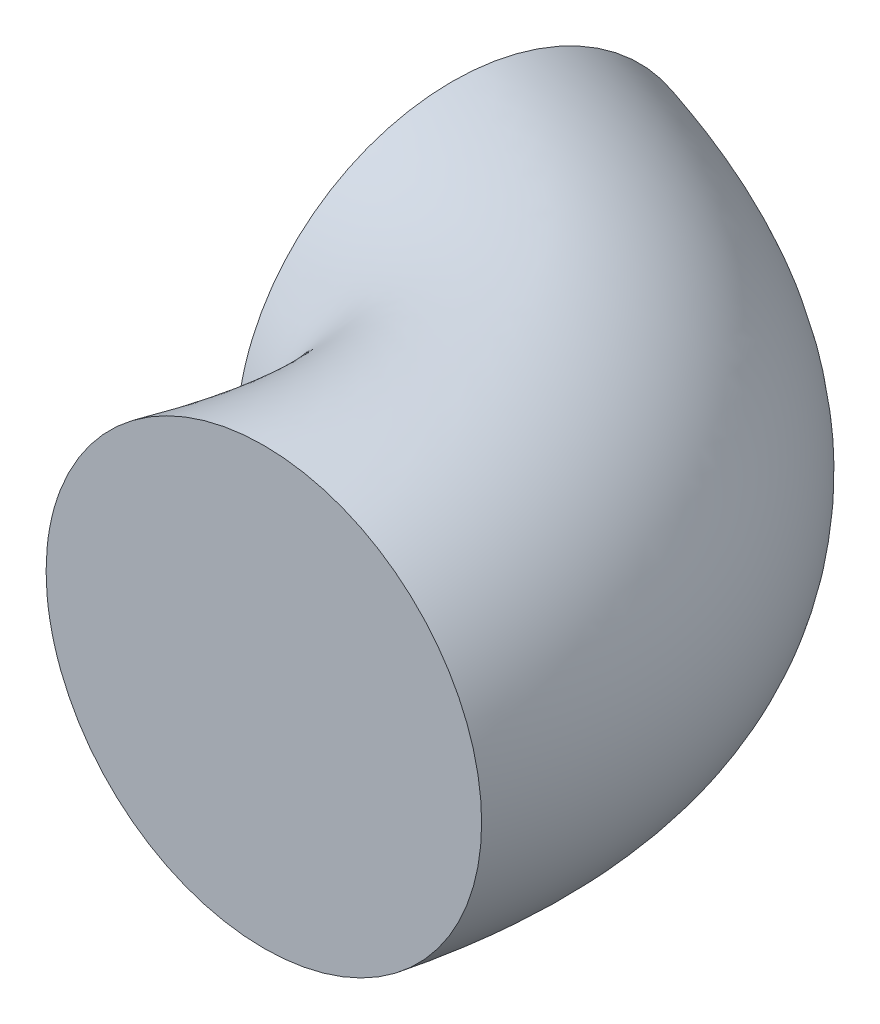
ISO-10303-21;
HEADER;
FILE_DESCRIPTION(('STEP AP214'),'2;1');
FILE_NAME('part.step','',(''),(''),'','','');
FILE_SCHEMA(('AUTOMOTIVE_DESIGN { 1 0 10303 214 1 1 1 1 }'));
ENDSEC;
DATA;
#1=APPLICATION_CONTEXT('core data for automotive mechanical design processes');
#2=APPLICATION_PROTOCOL_DEFINITION('international standard','automotive_design',2000,#1);
#3=PRODUCT_CONTEXT('',#1,'mechanical');
#4=PRODUCT('Part','Part','',(#3));
#5=PRODUCT_RELATED_PRODUCT_CATEGORY('part','',(#4));
#6=PRODUCT_DEFINITION_FORMATION('','',#4);
#7=PRODUCT_DEFINITION_CONTEXT('part definition',#1,'design');
#8=PRODUCT_DEFINITION('design','',#6,#7);
#9=PRODUCT_DEFINITION_SHAPE('','',#8);
#10=(LENGTH_UNIT() NAMED_UNIT(*) SI_UNIT(.MILLI.,.METRE.));
#11=(NAMED_UNIT(*) PLANE_ANGLE_UNIT() SI_UNIT($,.RADIAN.));
#12=(NAMED_UNIT(*) SI_UNIT($,.STERADIAN.) SOLID_ANGLE_UNIT());
#13=UNCERTAINTY_MEASURE_WITH_UNIT(LENGTH_MEASURE(1.E-05),#10,'distance_accuracy_value','');
#14=(GEOMETRIC_REPRESENTATION_CONTEXT(3) GLOBAL_UNCERTAINTY_ASSIGNED_CONTEXT((#13)) GLOBAL_UNIT_ASSIGNED_CONTEXT((#10,
#11,#12)) REPRESENTATION_CONTEXT('',''));
#15=CARTESIAN_POINT('',(0.,0.,0.));
#16=DIRECTION('',(0.,0.,1.));
#17=DIRECTION('',(1.,0.,0.));
#18=AXIS2_PLACEMENT_3D('',#15,#16,#17);
#19=CARTESIAN_POINT('',(0.,0.,0.));
#20=DIRECTION('',(0.,0.,1.));
#21=DIRECTION('',(1.,0.,0.));
#22=AXIS2_PLACEMENT_3D('',#19,#20,#21);
#23=PLANE('',#22);
#24=CARTESIAN_POINT('',(0.,0.,0.));
#25=DIRECTION('',(0.,0.,1.));
#26=DIRECTION('',(1.,0.,0.));
#27=AXIS2_PLACEMENT_3D('',#24,#25,#26);
#28=CIRCLE('',#27,40.);
#29=CARTESIAN_POINT('',(40.,0.,0.));
#30=VERTEX_POINT('',#29);
#31=EDGE_CURVE('E47',#30,#30,#28,.T.);
#32=ORIENTED_EDGE('',*,*,#31,.T.);
#33=EDGE_LOOP('',(#32));
#34=FACE_BOUND('',#33,.T.);
#35=ADVANCED_FACE('F39',(#34),#23,.T.);
#36=CARTESIAN_POINT('',(-40.4408541027692,0.,-78.83117071583));
#37=DIRECTION('',(0.996086700725007,0.,0.0883814722595809));
#38=DIRECTION('',(0.0883814722595808,0.,-0.996086700725007));
#39=AXIS2_PLACEMENT_3D('',#36,#37,#38);
#40=PLANE('',#39);
#41=CARTESIAN_POINT('',(-40.4408541027692,0.,-78.83117071583));
#42=DIRECTION('',(0.996086700725007,0.,0.0883814722595809));
#43=DIRECTION('',(0.0883814722595808,0.,-0.996086700725007));
#44=AXIS2_PLACEMENT_3D('',#41,#42,#43);
#45=CIRCLE('',#44,40.);
#46=CARTESIAN_POINT('',(-36.905595212386,0.,-118.67463874483));
#47=VERTEX_POINT('',#46);
#48=EDGE_CURVE('E11',#47,#47,#45,.T.);
#49=ORIENTED_EDGE('',*,*,#48,.F.);
#50=EDGE_LOOP('',(#49));
#51=FACE_BOUND('',#50,.T.);
#52=ADVANCED_FACE('F56',(#51),#40,.F.);
#53=CARTESIAN_POINT('',(40.,0.,0.));
#54=CARTESIAN_POINT('',(41.3868633275724,0.,-6.42714528030084));
#55=CARTESIAN_POINT('',(42.2794794591137,0.,-12.879265069234));
#56=CARTESIAN_POINT('',(42.8894237157453,0.,-25.8360629610387));
#57=CARTESIAN_POINT('',(42.6035014713239,0.,-32.3441915026831));
#58=CARTESIAN_POINT('',(40.6410862903865,0.,-45.2635927546872));
#59=CARTESIAN_POINT('',(38.9576013367702,0.,-51.673766230571));
#60=CARTESIAN_POINT('',(34.1148617388908,0.,-64.0296245239256));
#61=CARTESIAN_POINT('',(30.9535942018658,0.,-69.9654829875678));
#62=CARTESIAN_POINT('',(23.3777656487891,0.,-80.9473315117847));
#63=CARTESIAN_POINT('',(18.972415894819,0.,-85.9864850754642));
#64=CARTESIAN_POINT('',(9.3343969647454,0.,-94.9989111522192));
#65=CARTESIAN_POINT('',(4.10925379983027,0.,-98.9766913428856));
#66=CARTESIAN_POINT('',(-6.84631293416658,0.,-105.984254078732));
#67=CARTESIAN_POINT('',(-12.5775025629617,0.,-109.02015427122));
#68=CARTESIAN_POINT('',(-24.4360636935081,0.,-114.355374739568));
#69=CARTESIAN_POINT('',(-30.5666325441854,0.,-116.65684792158));
#70=CARTESIAN_POINT('',(-36.905595212386,0.,-118.67463874483));
#71=CARTESIAN_POINT('',(40.,80.,0.));
#72=CARTESIAN_POINT('',(41.3868633275724,80.,-6.42714528030084));
#73=CARTESIAN_POINT('',(42.2794794591137,80.,-12.879265069234));
#74=CARTESIAN_POINT('',(42.8894237157453,80.,-25.8360629610387));
#75=CARTESIAN_POINT('',(42.6035014713239,80.,-32.3441915026831));
#76=CARTESIAN_POINT('',(40.6410862903865,80.,-45.2635927546872));
#77=CARTESIAN_POINT('',(38.9576013367702,80.,-51.673766230571));
#78=CARTESIAN_POINT('',(34.1148617388908,80.,-64.0296245239256));
#79=CARTESIAN_POINT('',(30.9535942018658,80.,-69.9654829875678));
#80=CARTESIAN_POINT('',(23.3777656487891,80.,-80.9473315117847));
#81=CARTESIAN_POINT('',(18.972415894819,80.,-85.9864850754642));
#82=CARTESIAN_POINT('',(9.3343969647454,80.,-94.9989111522192));
#83=CARTESIAN_POINT('',(4.10925379983027,80.,-98.9766913428856));
#84=CARTESIAN_POINT('',(-6.84631293416658,80.,-105.984254078732));
#85=CARTESIAN_POINT('',(-12.5775025629617,80.,-109.02015427122));
#86=CARTESIAN_POINT('',(-24.4360636935081,80.,-114.355374739568));
#87=CARTESIAN_POINT('',(-30.5666325441854,80.,-116.65684792158));
#88=CARTESIAN_POINT('',(-36.905595212386,80.,-118.67463874483));
#89=CARTESIAN_POINT('',(-40.,80.,0.));
#90=CARTESIAN_POINT('',(-38.6131366727671,80.,-2.95654411225123));
#91=CARTESIAN_POINT('',(-37.5000008781683,80.,-5.5363105700784));
#92=CARTESIAN_POINT('',(-35.6343907401273,80.,-9.9396788802866));
#93=CARTESIAN_POINT('',(-34.8786660271351,80.,-11.7598302938112));
#94=CARTESIAN_POINT('',(-33.5125953665764,80.,-14.7933826607446));
#95=CARTESIAN_POINT('',(-32.8952574019161,80.,-16.0078828484597));
#96=CARTESIAN_POINT('',(-31.7207612394385,80.,-18.1977655909087));
#97=CARTESIAN_POINT('',(-31.1615901488894,80.,-19.1829744993687));
#98=CARTESIAN_POINT('',(-30.3259039462798,80.,-21.3396544277335));
#99=CARTESIAN_POINT('',(-30.0586000963036,80.,-22.5179619445854));
#100=CARTESIAN_POINT('',(-30.2326224317236,80.,-25.2368517374262));
#101=CARTESIAN_POINT('',(-30.6814746283394,80.,-26.7729263357132));
#102=CARTESIAN_POINT('',(-32.6098480748638,80.,-30.0894668862553));
#103=CARTESIAN_POINT('',(-34.0886032651016,80.,-31.8638151911836));
#104=CARTESIAN_POINT('',(-38.1858812301727,80.,-35.4454854261555));
#105=CARTESIAN_POINT('',(-40.8012066560469,80.,-37.2506544499008));
#106=CARTESIAN_POINT('',(-43.9761129931524,80.,-38.9877026868297));
#107=CARTESIAN_POINT('',(-40.,0.,0.));
#108=CARTESIAN_POINT('',(-38.6131366727671,0.,-2.95654411225123));
#109=CARTESIAN_POINT('',(-37.5000008781683,0.,-5.53631057007745));
#110=CARTESIAN_POINT('',(-35.6343907401273,0.,-9.93967888028755));
#111=CARTESIAN_POINT('',(-34.8786660271351,0.,-11.7598302938095));
#112=CARTESIAN_POINT('',(-33.5125953665764,0.,-14.7933826607463));
#113=CARTESIAN_POINT('',(-32.8952574019161,0.,-16.0078828484597));
#114=CARTESIAN_POINT('',(-31.7207612394385,0.,-18.1977655909087));
#115=CARTESIAN_POINT('',(-31.1615901488926,0.,-19.1829744993719));
#116=CARTESIAN_POINT('',(-30.3259039462766,0.,-21.3396544277303));
#117=CARTESIAN_POINT('',(-30.0586000963069,0.,-22.5179619445854));
#118=CARTESIAN_POINT('',(-30.2326224317203,0.,-25.2368517374262));
#119=CARTESIAN_POINT('',(-30.6814746283322,0.,-26.7729263357132));
#120=CARTESIAN_POINT('',(-32.609848074871,0.,-30.0894668862553));
#121=CARTESIAN_POINT('',(-34.0886032650937,0.,-31.8638151911836));
#122=CARTESIAN_POINT('',(-38.1858812301806,0.,-35.4454854261555));
#123=CARTESIAN_POINT('',(-40.8012066560381,0.,-37.2506544499008));
#124=CARTESIAN_POINT('',(-43.9761129931524,0.,-38.9877026868297));
#125=CARTESIAN_POINT('',(-40.,-80.,0.));
#126=CARTESIAN_POINT('',(-38.6131366727671,-80.,-2.95654411225123));
#127=CARTESIAN_POINT('',(-37.5000008781683,-80.,-5.5363105700765));
#128=CARTESIAN_POINT('',(-35.6343907401273,-80.,-9.9396788802885));
#129=CARTESIAN_POINT('',(-34.8786660271351,-80.,-11.7598302938078));
#130=CARTESIAN_POINT('',(-33.5125953665764,-80.,-14.793382660748));
#131=CARTESIAN_POINT('',(-32.8952574019161,-80.,-16.0078828484597));
#132=CARTESIAN_POINT('',(-31.7207612394385,-80.,-18.1977655909087));
#133=CARTESIAN_POINT('',(-31.1615901488958,-80.,-19.1829744993751));
#134=CARTESIAN_POINT('',(-30.3259039462734,-80.,-21.3396544277271));
#135=CARTESIAN_POINT('',(-30.0586000963102,-80.,-22.5179619445854));
#136=CARTESIAN_POINT('',(-30.232622431717,-80.,-25.2368517374262));
#137=CARTESIAN_POINT('',(-30.6814746283251,-80.,-26.7729263357132));
#138=CARTESIAN_POINT('',(-32.6098480748781,-80.,-30.0894668862553));
#139=CARTESIAN_POINT('',(-34.0886032650857,-80.,-31.8638151911836));
#140=CARTESIAN_POINT('',(-38.1858812301886,-80.,-35.4454854261555));
#141=CARTESIAN_POINT('',(-40.8012066560292,-80.,-37.2506544499007));
#142=CARTESIAN_POINT('',(-43.9761129931524,-80.,-38.9877026868297));
#143=CARTESIAN_POINT('',(40.,-80.,0.));
#144=CARTESIAN_POINT('',(41.3868633275724,-80.,-6.42714528030084));
#145=CARTESIAN_POINT('',(42.2794794591137,-80.,-12.879265069234));
#146=CARTESIAN_POINT('',(42.8894237157453,-80.,-25.8360629610387));
#147=CARTESIAN_POINT('',(42.6035014713239,-80.,-32.3441915026831));
#148=CARTESIAN_POINT('',(40.6410862903865,-80.,-45.2635927546872));
#149=CARTESIAN_POINT('',(38.9576013367702,-80.,-51.673766230571));
#150=CARTESIAN_POINT('',(34.1148617388908,-80.,-64.0296245239256));
#151=CARTESIAN_POINT('',(30.9535942018658,-80.,-69.9654829875678));
#152=CARTESIAN_POINT('',(23.3777656487891,-80.,-80.9473315117847));
#153=CARTESIAN_POINT('',(18.972415894819,-80.,-85.9864850754642));
#154=CARTESIAN_POINT('',(9.3343969647454,-80.,-94.9989111522192));
#155=CARTESIAN_POINT('',(4.10925379983027,-80.,-98.9766913428856));
#156=CARTESIAN_POINT('',(-6.84631293416658,-80.,-105.984254078732));
#157=CARTESIAN_POINT('',(-12.5775025629617,-80.,-109.02015427122));
#158=CARTESIAN_POINT('',(-24.4360636935081,-80.,-114.355374739568));
#159=CARTESIAN_POINT('',(-30.5666325441854,-80.,-116.65684792158));
#160=CARTESIAN_POINT('',(-36.905595212386,-80.,-118.67463874483));
#161=CARTESIAN_POINT('',(40.,0.,0.));
#162=CARTESIAN_POINT('',(41.3868633275724,0.,-6.42714528030084));
#163=CARTESIAN_POINT('',(42.2794794591137,0.,-12.879265069234));
#164=CARTESIAN_POINT('',(42.8894237157453,0.,-25.8360629610387));
#165=CARTESIAN_POINT('',(42.6035014713239,0.,-32.3441915026831));
#166=CARTESIAN_POINT('',(40.6410862903865,0.,-45.2635927546872));
#167=CARTESIAN_POINT('',(38.9576013367702,0.,-51.673766230571));
#168=CARTESIAN_POINT('',(34.1148617388908,0.,-64.0296245239256));
#169=CARTESIAN_POINT('',(30.9535942018658,0.,-69.9654829875678));
#170=CARTESIAN_POINT('',(23.3777656487891,0.,-80.9473315117847));
#171=CARTESIAN_POINT('',(18.972415894819,0.,-85.9864850754642));
#172=CARTESIAN_POINT('',(9.3343969647454,0.,-94.9989111522192));
#173=CARTESIAN_POINT('',(4.10925379983027,0.,-98.9766913428856));
#174=CARTESIAN_POINT('',(-6.84631293416658,0.,-105.984254078732));
#175=CARTESIAN_POINT('',(-12.5775025629617,0.,-109.02015427122));
#176=CARTESIAN_POINT('',(-24.4360636935081,0.,-114.355374739568));
#177=CARTESIAN_POINT('',(-30.5666325441854,0.,-116.65684792158));
#178=CARTESIAN_POINT('',(-36.905595212386,0.,-118.67463874483));
#179=(BOUNDED_SURFACE() B_SPLINE_SURFACE(3,3,((#53,#54,#55,#56,#57,#58,#59,#60,#61,#62,#63,#64,
#65,#66,#67,#68,#69,#70),(#71,#72,#73,#74,#75,#76,#77,#78,#79,#80,#81,#82,#83,#84,#85,#86,#87,
#88),(#89,#90,#91,#92,#93,#94,#95,#96,#97,#98,#99,#100,#101,#102,#103,#104,#105,#106),(#107,
#108,#109,#110,#111,#112,#113,#114,#115,#116,#117,#118,#119,#120,#121,#122,#123,#124),(#125,
#126,#127,#128,#129,#130,#131,#132,#133,#134,#135,#136,#137,#138,#139,#140,#141,#142),(#143,
#144,#145,#146,#147,#148,#149,#150,#151,#152,#153,#154,#155,#156,#157,#158,#159,#160),(#161,
#162,#163,#164,#165,#166,#167,#168,#169,#170,#171,#172,#173,#174,#175,#176,#177,#178)),
.UNSPECIFIED.,.T.,.F.,.F.) B_SPLINE_SURFACE_WITH_KNOTS((4,3,4),(4,2,2,2,2,2,2,2,4),(0.,0.5,1.),
(0.,0.125,0.25,0.375,0.5,0.625,0.75,0.875,1.),
.UNSPECIFIED.) GEOMETRIC_REPRESENTATION_ITEM() RATIONAL_B_SPLINE_SURFACE(((1.,1.,1.,1.,1.,1.,1.,
1.,1.,1.,1.,1.,1.,1.,1.,1.,1.,1.),(0.333333333333333,0.333333333333333,0.333333333333333,
0.333333333333333,0.333333333333333,0.333333333333333,0.333333333333333,0.333333333333333,
0.333333333333333,0.333333333333333,0.333333333333333,0.333333333333333,0.333333333333333,
0.333333333333333,0.333333333333333,0.333333333333333,0.333333333333333,0.333333333333333),
(0.333333333333333,0.333333333333333,0.333333333333333,0.333333333333333,0.333333333333333,
0.333333333333333,0.333333333333333,0.333333333333333,0.333333333333333,0.333333333333333,
0.333333333333333,0.333333333333333,0.333333333333333,0.333333333333333,0.333333333333333,
0.333333333333333,0.333333333333333,0.333333333333333),(1.,1.,1.,1.,1.,1.,1.,1.,1.,1.,1.,1.,1.,
1.,1.,1.,1.,1.),(0.333333333333333,0.333333333333333,0.333333333333333,0.333333333333333,
0.333333333333333,0.333333333333333,0.333333333333333,0.333333333333333,0.333333333333333,
0.333333333333333,0.333333333333333,0.333333333333333,0.333333333333333,0.333333333333333,
0.333333333333333,0.333333333333333,0.333333333333333,0.333333333333333),(0.333333333333333,
0.333333333333333,0.333333333333333,0.333333333333333,0.333333333333333,0.333333333333333,
0.333333333333333,0.333333333333333,0.333333333333333,0.333333333333333,0.333333333333333,
0.333333333333333,0.333333333333333,0.333333333333333,0.333333333333333,0.333333333333333,
0.333333333333333,0.333333333333333),(1.,1.,1.,1.,1.,1.,1.,1.,1.,1.,1.,1.,1.,1.,1.,1.,1.,1.))) REPRESENTATION_ITEM('') SURFACE());
#180=ORIENTED_EDGE('',*,*,#48,.T.);
#181=EDGE_LOOP('',(#180));
#182=FACE_BOUND('',#181,.T.);
#183=ORIENTED_EDGE('',*,*,#31,.F.);
#184=EDGE_LOOP('',(#183));
#185=FACE_BOUND('',#184,.T.);
#186=ADVANCED_FACE('F54',(#182,#185),#179,.F.);
#187=CLOSED_SHELL('',(#35,#52,#186));
#188=MANIFOLD_SOLID_BREP('B2',#187);
#189=ADVANCED_BREP_SHAPE_REPRESENTATION('',(#18,#188),#14);
#190=SHAPE_DEFINITION_REPRESENTATION(#9,#189);
ENDSEC;
END-ISO-10303-21;
